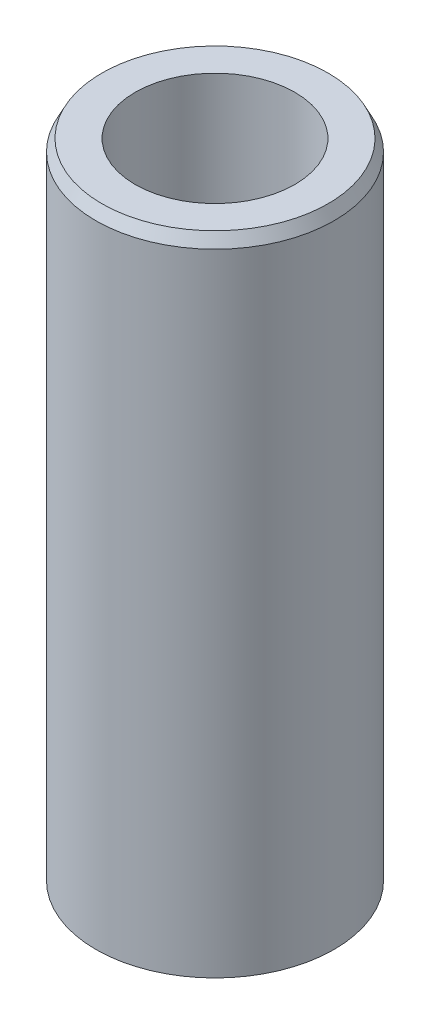
ISO-10303-21;
HEADER;
FILE_DESCRIPTION(('STEP AP214'),'2;1');
FILE_NAME('part.step','',(''),(''),'','','');
FILE_SCHEMA(('AUTOMOTIVE_DESIGN { 1 0 10303 214 1 1 1 1 }'));
ENDSEC;
DATA;
#1=APPLICATION_CONTEXT('core data for automotive mechanical design processes');
#2=APPLICATION_PROTOCOL_DEFINITION('international standard','automotive_design',2000,#1);
#3=PRODUCT_CONTEXT('',#1,'mechanical');
#4=PRODUCT('Part','Part','',(#3));
#5=PRODUCT_RELATED_PRODUCT_CATEGORY('part','',(#4));
#6=PRODUCT_DEFINITION_FORMATION('','',#4);
#7=PRODUCT_DEFINITION_CONTEXT('part definition',#1,'design');
#8=PRODUCT_DEFINITION('design','',#6,#7);
#9=PRODUCT_DEFINITION_SHAPE('','',#8);
#10=(LENGTH_UNIT() NAMED_UNIT(*) SI_UNIT(.MILLI.,.METRE.));
#11=(NAMED_UNIT(*) PLANE_ANGLE_UNIT() SI_UNIT($,.RADIAN.));
#12=(NAMED_UNIT(*) SI_UNIT($,.STERADIAN.) SOLID_ANGLE_UNIT());
#13=UNCERTAINTY_MEASURE_WITH_UNIT(LENGTH_MEASURE(1.E-05),#10,'distance_accuracy_value','');
#14=(GEOMETRIC_REPRESENTATION_CONTEXT(3) GLOBAL_UNCERTAINTY_ASSIGNED_CONTEXT((#13)) GLOBAL_UNIT_ASSIGNED_CONTEXT((#10,
#11,#12)) REPRESENTATION_CONTEXT('',''));
#15=CARTESIAN_POINT('',(0.,0.,0.));
#16=DIRECTION('',(0.,0.,1.));
#17=DIRECTION('',(1.,0.,0.));
#18=AXIS2_PLACEMENT_3D('',#15,#16,#17);
#19=CARTESIAN_POINT('',(0.,313.081789055045,0.));
#20=DIRECTION('',(0.,-1.,0.));
#21=DIRECTION('',(0.,0.,-1.));
#22=AXIS2_PLACEMENT_3D('',#19,#20,#21);
#23=CYLINDRICAL_SURFACE('',#22,57.5);
#24=CARTESIAN_POINT('',(0.,307.411448631231,0.));
#25=DIRECTION('',(0.,1.,0.));
#26=DIRECTION('',(0.,0.,1.));
#27=AXIS2_PLACEMENT_3D('',#24,#25,#26);
#28=CIRCLE('',#27,57.5);
#29=CARTESIAN_POINT('',(0.,307.411448631231,57.5));
#30=VERTEX_POINT('',#29);
#31=EDGE_CURVE('E50',#30,#30,#28,.F.);
#32=ORIENTED_EDGE('',*,*,#31,.T.);
#33=EDGE_LOOP('',(#32));
#34=FACE_BOUND('',#33,.T.);
#35=CARTESIAN_POINT('',(0.,2.89267503093471,0.));
#36=DIRECTION('',(0.,1.,0.));
#37=DIRECTION('',(0.,0.,1.));
#38=AXIS2_PLACEMENT_3D('',#35,#36,#37);
#39=CIRCLE('',#38,57.5);
#40=CARTESIAN_POINT('',(0.,2.89267503093471,57.5));
#41=VERTEX_POINT('',#40);
#42=EDGE_CURVE('E51',#41,#41,#39,.T.);
#43=ORIENTED_EDGE('',*,*,#42,.T.);
#44=EDGE_LOOP('',(#43));
#45=FACE_BOUND('',#44,.T.);
#46=ADVANCED_FACE('F39',(#34,#45),#23,.T.);
#47=CARTESIAN_POINT('',(0.,313.081789055045,0.));
#48=DIRECTION('',(0.,1.,0.));
#49=DIRECTION('',(0.,0.,1.));
#50=AXIS2_PLACEMENT_3D('',#47,#48,#49);
#51=PLANE('',#50);
#52=CARTESIAN_POINT('',(0.,313.081789055045,0.));
#53=DIRECTION('',(0.,1.,0.));
#54=DIRECTION('',(0.,0.,1.));
#55=AXIS2_PLACEMENT_3D('',#52,#53,#54);
#56=CIRCLE('',#55,54.6073249690653);
#57=CARTESIAN_POINT('',(0.,313.081789055045,54.6073249690653));
#58=VERTEX_POINT('',#57);
#59=EDGE_CURVE('E54',#58,#58,#56,.T.);
#60=ORIENTED_EDGE('',*,*,#59,.T.);
#61=EDGE_LOOP('',(#60));
#62=FACE_BOUND('',#61,.T.);
#63=CARTESIAN_POINT('',(0.,313.081789055045,0.));
#64=DIRECTION('',(0.,1.,0.));
#65=DIRECTION('',(0.,0.,1.));
#66=AXIS2_PLACEMENT_3D('',#63,#64,#65);
#67=CIRCLE('',#66,38.5424390881841);
#68=CARTESIAN_POINT('',(0.,313.081789055045,38.5424390881841));
#69=VERTEX_POINT('',#68);
#70=EDGE_CURVE('E58',#69,#69,#67,.T.);
#71=ORIENTED_EDGE('',*,*,#70,.F.);
#72=EDGE_LOOP('',(#71));
#73=FACE_BOUND('',#72,.T.);
#74=ADVANCED_FACE('F69',(#62,#73),#51,.T.);
#75=CARTESIAN_POINT('',(0.,0.,0.));
#76=DIRECTION('',(0.,1.,0.));
#77=DIRECTION('',(0.,0.,1.));
#78=AXIS2_PLACEMENT_3D('',#75,#76,#77);
#79=PLANE('',#78);
#80=CARTESIAN_POINT('',(0.,0.,0.));
#81=DIRECTION('',(0.,1.,0.));
#82=DIRECTION('',(0.,0.,1.));
#83=AXIS2_PLACEMENT_3D('',#80,#81,#82);
#84=CIRCLE('',#83,51.8296595761858);
#85=CARTESIAN_POINT('',(0.,0.,51.8296595761858));
#86=VERTEX_POINT('',#85);
#87=EDGE_CURVE('E10',#86,#86,#84,.F.);
#88=ORIENTED_EDGE('',*,*,#87,.T.);
#89=EDGE_LOOP('',(#88));
#90=FACE_BOUND('',#89,.T.);
#91=CARTESIAN_POINT('',(0.,0.,0.));
#92=DIRECTION('',(0.,1.,0.));
#93=DIRECTION('',(0.,0.,1.));
#94=AXIS2_PLACEMENT_3D('',#91,#92,#93);
#95=CIRCLE('',#94,38.5424390881841);
#96=CARTESIAN_POINT('',(0.,0.,38.5424390881841));
#97=VERTEX_POINT('',#96);
#98=EDGE_CURVE('E63',#97,#97,#95,.T.);
#99=ORIENTED_EDGE('',*,*,#98,.T.);
#100=EDGE_LOOP('',(#99));
#101=FACE_BOUND('',#100,.T.);
#102=ADVANCED_FACE('F75',(#90,#101),#79,.F.);
#103=CARTESIAN_POINT('',(0.,313.081789055045,0.));
#104=DIRECTION('',(0.,-1.,0.));
#105=DIRECTION('',(0.,0.,-1.));
#106=AXIS2_PLACEMENT_3D('',#103,#104,#105);
#107=CYLINDRICAL_SURFACE('',#106,38.5424390881841);
#108=ORIENTED_EDGE('',*,*,#70,.T.);
#109=EDGE_LOOP('',(#108));
#110=FACE_BOUND('',#109,.T.);
#111=ORIENTED_EDGE('',*,*,#98,.F.);
#112=EDGE_LOOP('',(#111));
#113=FACE_BOUND('',#112,.T.);
#114=ADVANCED_FACE('F70',(#110,#113),#107,.F.);
#115=CARTESIAN_POINT('',(0.,313.081789055045,0.));
#116=DIRECTION('',(0.,-1.,0.));
#117=DIRECTION('',(0.,0.,-1.));
#118=AXIS2_PLACEMENT_3D('',#115,#116,#117);
#119=CONICAL_SURFACE('',#118,54.6073249690653,0.471727722791252);
#120=ORIENTED_EDGE('',*,*,#31,.F.);
#121=EDGE_LOOP('',(#120));
#122=FACE_BOUND('',#121,.T.);
#123=ORIENTED_EDGE('',*,*,#59,.F.);
#124=EDGE_LOOP('',(#123));
#125=FACE_BOUND('',#124,.T.);
#126=ADVANCED_FACE('F81',(#122,#125),#119,.T.);
#127=CARTESIAN_POINT('',(0.,2.89267503093471,0.));
#128=DIRECTION('',(0.,1.,0.));
#129=DIRECTION('',(0.,0.,1.));
#130=AXIS2_PLACEMENT_3D('',#127,#128,#129);
#131=CONICAL_SURFACE('',#130,57.5,1.09906860400364);
#132=ORIENTED_EDGE('',*,*,#87,.F.);
#133=EDGE_LOOP('',(#132));
#134=FACE_BOUND('',#133,.T.);
#135=ORIENTED_EDGE('',*,*,#42,.F.);
#136=EDGE_LOOP('',(#135));
#137=FACE_BOUND('',#136,.T.);
#138=ADVANCED_FACE('F45',(#134,#137),#131,.T.);
#139=CLOSED_SHELL('',(#46,#74,#102,#114,#126,#138));
#140=MANIFOLD_SOLID_BREP('B2',#139);
#141=ADVANCED_BREP_SHAPE_REPRESENTATION('',(#18,#140),#14);
#142=SHAPE_DEFINITION_REPRESENTATION(#9,#141);
ENDSEC;
END-ISO-10303-21;
